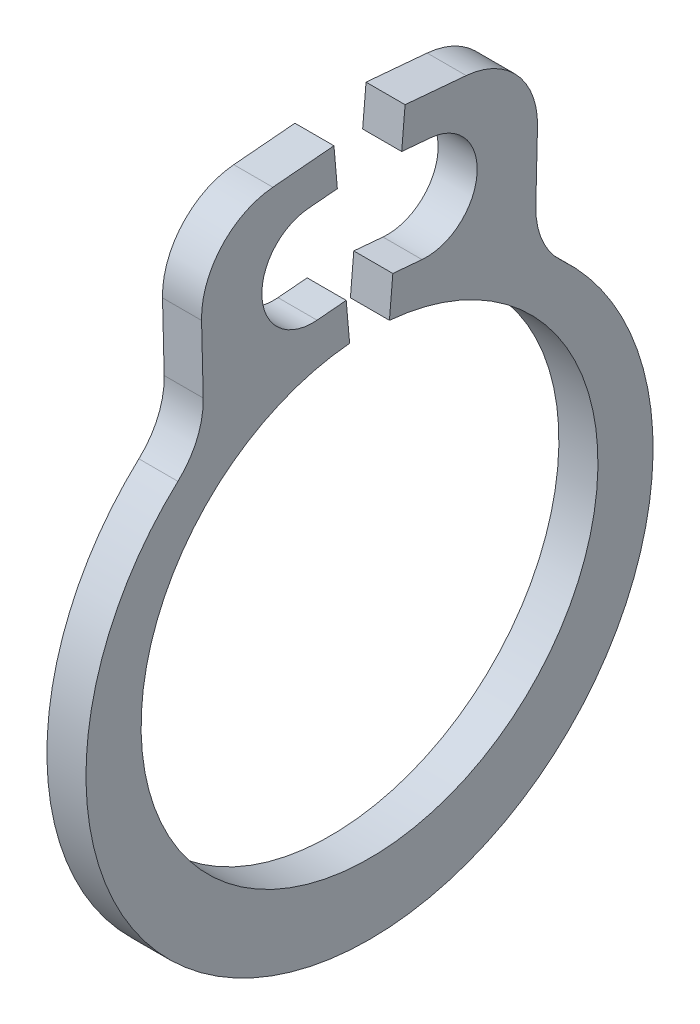
ISO-10303-21;
HEADER;
FILE_DESCRIPTION(('STEP AP214'),'2;1');
FILE_NAME('part.step','',(''),(''),'','','');
FILE_SCHEMA(('AUTOMOTIVE_DESIGN { 1 0 10303 214 1 1 1 1 }'));
ENDSEC;
DATA;
#1=APPLICATION_CONTEXT('core data for automotive mechanical design processes');
#2=APPLICATION_PROTOCOL_DEFINITION('international standard','automotive_design',2000,#1);
#3=PRODUCT_CONTEXT('',#1,'mechanical');
#4=PRODUCT('Part','Part','',(#3));
#5=PRODUCT_RELATED_PRODUCT_CATEGORY('part','',(#4));
#6=PRODUCT_DEFINITION_FORMATION('','',#4);
#7=PRODUCT_DEFINITION_CONTEXT('part definition',#1,'design');
#8=PRODUCT_DEFINITION('design','',#6,#7);
#9=PRODUCT_DEFINITION_SHAPE('','',#8);
#10=(LENGTH_UNIT() NAMED_UNIT(*) SI_UNIT(.MILLI.,.METRE.));
#11=(NAMED_UNIT(*) PLANE_ANGLE_UNIT() SI_UNIT($,.RADIAN.));
#12=(NAMED_UNIT(*) SI_UNIT($,.STERADIAN.) SOLID_ANGLE_UNIT());
#13=UNCERTAINTY_MEASURE_WITH_UNIT(LENGTH_MEASURE(1.E-05),#10,'distance_accuracy_value','');
#14=(GEOMETRIC_REPRESENTATION_CONTEXT(3) GLOBAL_UNCERTAINTY_ASSIGNED_CONTEXT((#13)) GLOBAL_UNIT_ASSIGNED_CONTEXT((#10,
#11,#12)) REPRESENTATION_CONTEXT('',''));
#15=CARTESIAN_POINT('',(0.,0.,0.));
#16=DIRECTION('',(0.,0.,1.));
#17=DIRECTION('',(1.,0.,0.));
#18=AXIS2_PLACEMENT_3D('',#15,#16,#17);
#19=CARTESIAN_POINT('',(0.126999999999933,0.,0.));
#20=DIRECTION('',(-1.,0.,0.));
#21=DIRECTION('',(0.,0.,0.999999999999998));
#22=AXIS2_PLACEMENT_3D('',#19,#20,#21);
#23=CYLINDRICAL_SURFACE('',#22,1.4859);
#24=CARTESIAN_POINT('',(-0.127000000000023,0.,0.));
#25=DIRECTION('',(-1.,0.,0.));
#26=DIRECTION('',(0.,0.,-0.999999999999998));
#27=AXIS2_PLACEMENT_3D('',#24,#25,#26);
#28=CIRCLE('',#27,1.4859);
#29=CARTESIAN_POINT('',(-0.127000000000016,1.48024570189442,-0.129504718148821));
#30=VERTEX_POINT('',#29);
#31=CARTESIAN_POINT('',(-0.127000000000044,1.48024570189445,0.12950471814871));
#32=VERTEX_POINT('',#31);
#33=EDGE_CURVE('E197',#30,#32,#28,.T.);
#34=ORIENTED_EDGE('',*,*,#33,.T.);
#35=DIRECTION('',(-1.,0.,0.));
#36=VECTOR('',#35,1.);
#37=CARTESIAN_POINT('',(0.127000000000002,1.48024570189445,0.129504718148737));
#38=LINE('',#37,#36);
#39=CARTESIAN_POINT('',(0.127000000000002,1.48024570189445,0.129504718148737));
#40=VERTEX_POINT('',#39);
#41=EDGE_CURVE('E179',#40,#32,#38,.T.);
#42=ORIENTED_EDGE('',*,*,#41,.F.);
#43=CARTESIAN_POINT('',(0.126999999999933,0.,0.));
#44=DIRECTION('',(-1.,0.,0.));
#45=DIRECTION('',(0.,0.,-0.999999999999998));
#46=AXIS2_PLACEMENT_3D('',#43,#44,#45);
#47=CIRCLE('',#46,1.4859);
#48=CARTESIAN_POINT('',(0.126999999999912,1.48024570189452,-0.129504718148765));
#49=VERTEX_POINT('',#48);
#50=EDGE_CURVE('E185',#49,#40,#47,.T.);
#51=ORIENTED_EDGE('',*,*,#50,.F.);
#52=DIRECTION('',(-1.,0.,0.));
#53=VECTOR('',#52,1.);
#54=CARTESIAN_POINT('',(0.126999999999912,1.48024570189452,-0.129504718148765));
#55=LINE('',#54,#53);
#56=EDGE_CURVE('E275',#49,#30,#55,.T.);
#57=ORIENTED_EDGE('',*,*,#56,.T.);
#58=EDGE_LOOP('',(#34,#42,#51,#57));
#59=FACE_BOUND('',#58,.T.);
#60=ADVANCED_FACE('F36',(#59),#23,.F.);
#61=CARTESIAN_POINT('',(0.126999999999995,1.73327915520979,0.151642276806613));
#62=DIRECTION('',(0.,-0.0871557427476581,0.996194698091745));
#63=DIRECTION('',(0.,-0.996194698091744,-0.0871557427476577));
#64=AXIS2_PLACEMENT_3D('',#61,#62,#63);
#65=PLANE('',#64);
#66=DIRECTION('',(0.,0.996194698091744,0.0871557427476577));
#67=VECTOR('',#66,1.);
#68=CARTESIAN_POINT('',(-0.127000000000058,1.73327915520976,0.151642276806641));
#69=LINE('',#68,#67);
#70=CARTESIAN_POINT('',(-0.127000000000058,1.73327915520976,0.151642276806641));
#71=VERTEX_POINT('',#70);
#72=EDGE_CURVE('E277',#32,#71,#69,.T.);
#73=ORIENTED_EDGE('',*,*,#72,.T.);
#74=DIRECTION('',(-1.,0.,0.));
#75=VECTOR('',#74,1.);
#76=CARTESIAN_POINT('',(0.126999999999995,1.73327915520979,0.151642276806613));
#77=LINE('',#76,#75);
#78=CARTESIAN_POINT('',(0.126999999999995,1.73327915520979,0.151642276806613));
#79=VERTEX_POINT('',#78);
#80=EDGE_CURVE('E182',#79,#71,#77,.T.);
#81=ORIENTED_EDGE('',*,*,#80,.F.);
#82=DIRECTION('',(0.,0.996194698091744,0.0871557427476577));
#83=VECTOR('',#82,1.);
#84=CARTESIAN_POINT('',(0.126999999999995,1.73327915520979,0.151642276806613));
#85=LINE('',#84,#83);
#86=EDGE_CURVE('E175',#40,#79,#85,.T.);
#87=ORIENTED_EDGE('',*,*,#86,.F.);
#88=ORIENTED_EDGE('',*,*,#41,.T.);
#89=EDGE_LOOP('',(#73,#81,#87,#88));
#90=FACE_BOUND('',#89,.T.);
#91=ADVANCED_FACE('F177',(#90),#65,.F.);
#92=CARTESIAN_POINT('',(0.126999999999995,1.73327915520979,0.151642276806613));
#93=DIRECTION('',(0.,-0.996194698091743,-0.0871557427476583));
#94=DIRECTION('',(0.,0.087155742747658,-0.996194698091743));
#95=AXIS2_PLACEMENT_3D('',#92,#93,#94);
#96=PLANE('',#95);
#97=DIRECTION('',(0.,-0.087155742747658,0.996194698091743));
#98=VECTOR('',#97,1.);
#99=CARTESIAN_POINT('',(-0.127000000000058,1.73327915520976,0.151642276806641));
#100=LINE('',#99,#98);
#101=CARTESIAN_POINT('',(-0.126999999999995,1.71667598621633,0.341417366793106));
#102=VERTEX_POINT('',#101);
#103=EDGE_CURVE('E279',#71,#102,#100,.T.);
#104=ORIENTED_EDGE('',*,*,#103,.T.);
#105=DIRECTION('',(-1.,0.,0.));
#106=VECTOR('',#105,1.);
#107=CARTESIAN_POINT('',(0.126999999999988,1.71667598621627,0.341417366793106));
#108=LINE('',#107,#106);
#109=CARTESIAN_POINT('',(0.126999999999988,1.71667598621627,0.341417366793106));
#110=VERTEX_POINT('',#109);
#111=EDGE_CURVE('E202',#110,#102,#108,.T.);
#112=ORIENTED_EDGE('',*,*,#111,.F.);
#113=DIRECTION('',(0.,-0.087155742747658,0.996194698091743));
#114=VECTOR('',#113,1.);
#115=CARTESIAN_POINT('',(0.126999999999995,1.73327915520979,0.151642276806613));
#116=LINE('',#115,#114);
#117=EDGE_CURVE('E184',#79,#110,#116,.T.);
#118=ORIENTED_EDGE('',*,*,#117,.F.);
#119=ORIENTED_EDGE('',*,*,#80,.T.);
#120=EDGE_LOOP('',(#104,#112,#118,#119));
#121=FACE_BOUND('',#120,.T.);
#122=ADVANCED_FACE('F381',(#121),#96,.F.);
#123=CARTESIAN_POINT('',(0.126999999999919,2.04561947552623,0.3701961930484));
#124=DIRECTION('',(-1.,0.,0.));
#125=DIRECTION('',(0.,0.,0.999999999999998));
#126=AXIS2_PLACEMENT_3D('',#123,#124,#125);
#127=CYLINDRICAL_SURFACE('',#126,0.3302);
#128=CARTESIAN_POINT('',(-0.127000000000072,2.04561947552622,0.370196193048386));
#129=DIRECTION('',(-1.,0.,0.));
#130=DIRECTION('',(0.,0.,0.999999999999998));
#131=AXIS2_PLACEMENT_3D('',#128,#129,#130);
#132=CIRCLE('',#131,0.3302);
#133=CARTESIAN_POINT('',(-0.127000000000051,2.37456296483611,0.398975019303652));
#134=VERTEX_POINT('',#133);
#135=EDGE_CURVE('E281',#102,#134,#132,.T.);
#136=ORIENTED_EDGE('',*,*,#135,.T.);
#137=DIRECTION('',(-1.,0.,0.));
#138=VECTOR('',#137,1.);
#139=CARTESIAN_POINT('',(0.126999999999988,2.37456296483612,0.398975019303666));
#140=LINE('',#139,#138);
#141=CARTESIAN_POINT('',(0.126999999999988,2.37456296483612,0.398975019303666));
#142=VERTEX_POINT('',#141);
#143=EDGE_CURVE('E325',#142,#134,#140,.T.);
#144=ORIENTED_EDGE('',*,*,#143,.F.);
#145=CARTESIAN_POINT('',(0.126999999999919,2.04561947552623,0.3701961930484));
#146=DIRECTION('',(-1.,0.,0.));
#147=DIRECTION('',(0.,0.,0.999999999999998));
#148=AXIS2_PLACEMENT_3D('',#145,#146,#147);
#149=CIRCLE('',#148,0.3302);
#150=EDGE_CURVE('E334',#110,#142,#149,.T.);
#151=ORIENTED_EDGE('',*,*,#150,.F.);
#152=ORIENTED_EDGE('',*,*,#111,.T.);
#153=EDGE_LOOP('',(#136,#144,#151,#152));
#154=FACE_BOUND('',#153,.T.);
#155=ADVANCED_FACE('F332',(#154),#127,.F.);
#156=CARTESIAN_POINT('',(0.126999999999995,2.39116613382955,0.209199929317172));
#157=DIRECTION('',(0.,0.996194698091743,0.0871557427476583));
#158=DIRECTION('',(0.,-0.087155742747658,0.996194698091743));
#159=AXIS2_PLACEMENT_3D('',#156,#157,#158);
#160=PLANE('',#159);
#161=DIRECTION('',(0.,0.087155742747658,-0.996194698091743));
#162=VECTOR('',#161,1.);
#163=CARTESIAN_POINT('',(-0.12700000000003,2.39116613382961,0.209199929317172));
#164=LINE('',#163,#162);
#165=CARTESIAN_POINT('',(-0.12700000000003,2.39116613382961,0.209199929317172));
#166=VERTEX_POINT('',#165);
#167=EDGE_CURVE('E283',#134,#166,#164,.T.);
#168=ORIENTED_EDGE('',*,*,#167,.T.);
#169=DIRECTION('',(-1.,0.,0.));
#170=VECTOR('',#169,1.);
#171=CARTESIAN_POINT('',(0.126999999999995,2.39116613382955,0.209199929317172));
#172=LINE('',#171,#170);
#173=CARTESIAN_POINT('',(0.126999999999995,2.39116613382955,0.209199929317172));
#174=VERTEX_POINT('',#173);
#175=EDGE_CURVE('E322',#174,#166,#172,.T.);
#176=ORIENTED_EDGE('',*,*,#175,.F.);
#177=DIRECTION('',(0.,0.087155742747658,-0.996194698091743));
#178=VECTOR('',#177,1.);
#179=CARTESIAN_POINT('',(0.126999999999995,2.39116613382955,0.209199929317172));
#180=LINE('',#179,#178);
#181=EDGE_CURVE('E350',#142,#174,#180,.T.);
#182=ORIENTED_EDGE('',*,*,#181,.F.);
#183=ORIENTED_EDGE('',*,*,#143,.T.);
#184=EDGE_LOOP('',(#168,#176,#182,#183));
#185=FACE_BOUND('',#184,.T.);
#186=ADVANCED_FACE('F342',(#185),#160,.F.);
#187=CARTESIAN_POINT('',(0.126999999999995,2.39116613382955,0.209199929317172));
#188=DIRECTION('',(0.,-0.0871557427476581,0.996194698091745));
#189=DIRECTION('',(0.,-0.996194698091744,-0.0871557427476577));
#190=AXIS2_PLACEMENT_3D('',#187,#188,#189);
#191=PLANE('',#190);
#192=DIRECTION('',(0.,0.996194698091744,0.0871557427476577));
#193=VECTOR('',#192,1.);
#194=CARTESIAN_POINT('',(-0.12700000000003,2.39116613382961,0.209199929317172));
#195=LINE('',#194,#193);
#196=CARTESIAN_POINT('',(-0.127000000000016,2.64419958714485,0.231337487975047));
#197=VERTEX_POINT('',#196);
#198=EDGE_CURVE('E285',#166,#197,#195,.T.);
#199=ORIENTED_EDGE('',*,*,#198,.T.);
#200=DIRECTION('',(-1.,0.,0.));
#201=VECTOR('',#200,1.);
#202=CARTESIAN_POINT('',(0.12699999999994,2.64419958714488,0.231337487975089));
#203=LINE('',#202,#201);
#204=CARTESIAN_POINT('',(0.12699999999994,2.64419958714488,0.231337487975089));
#205=VERTEX_POINT('',#204);
#206=EDGE_CURVE('E319',#205,#197,#203,.T.);
#207=ORIENTED_EDGE('',*,*,#206,.F.);
#208=DIRECTION('',(0.,0.996194698091744,0.0871557427476577));
#209=VECTOR('',#208,1.);
#210=CARTESIAN_POINT('',(0.126999999999995,2.39116613382955,0.209199929317172));
#211=LINE('',#210,#209);
#212=EDGE_CURVE('E348',#174,#205,#211,.T.);
#213=ORIENTED_EDGE('',*,*,#212,.F.);
#214=ORIENTED_EDGE('',*,*,#175,.T.);
#215=EDGE_LOOP('',(#199,#207,#213,#214));
#216=FACE_BOUND('',#215,.T.);
#217=ADVANCED_FACE('F346',(#216),#191,.F.);
#218=CARTESIAN_POINT('',(0.12699999999994,2.64419958714488,0.231337487975089));
#219=DIRECTION('',(0.,-0.996194698091744,-0.087155742747658));
#220=DIRECTION('',(0.,0.0871557427476574,-0.996194698091742));
#221=AXIS2_PLACEMENT_3D('',#218,#219,#220);
#222=PLANE('',#221);
#223=DIRECTION('',(0.,-0.0871557427476574,0.996194698091742));
#224=VECTOR('',#223,1.);
#225=CARTESIAN_POINT('',(-0.127000000000016,2.64419958714485,0.231337487975047));
#226=LINE('',#225,#224);
#227=CARTESIAN_POINT('',(-0.127000000000078,2.60940783718214,0.629009009753448));
#228=VERTEX_POINT('',#227);
#229=EDGE_CURVE('E287',#197,#228,#226,.T.);
#230=ORIENTED_EDGE('',*,*,#229,.T.);
#231=DIRECTION('',(-1.,0.,0.));
#232=VECTOR('',#231,1.);
#233=CARTESIAN_POINT('',(0.126999999999926,2.60940783718214,0.629009009753448));
#234=LINE('',#233,#232);
#235=CARTESIAN_POINT('',(0.126999999999926,2.60940783718214,0.629009009753448));
#236=VERTEX_POINT('',#235);
#237=EDGE_CURVE('E59',#228,#236,#234,.F.);
#238=ORIENTED_EDGE('',*,*,#237,.T.);
#239=DIRECTION('',(0.,-0.0871557427476574,0.996194698091742));
#240=VECTOR('',#239,1.);
#241=CARTESIAN_POINT('',(0.12699999999994,2.64419958714488,0.231337487975089));
#242=LINE('',#241,#240);
#243=EDGE_CURVE('E349',#205,#236,#242,.T.);
#244=ORIENTED_EDGE('',*,*,#243,.F.);
#245=ORIENTED_EDGE('',*,*,#206,.T.);
#246=EDGE_LOOP('',(#230,#238,#244,#245));
#247=FACE_BOUND('',#246,.T.);
#248=ADVANCED_FACE('F367',(#247),#222,.F.);
#249=CARTESIAN_POINT('',(0.127000000000002,2.56782500977515,1.10430290191291));
#250=DIRECTION('',(0.,0.0245695473898542,-0.999698123105698));
#251=DIRECTION('',(0.,0.999698123105698,0.0245695473898548));
#252=AXIS2_PLACEMENT_3D('',#249,#250,#251);
#253=PLANE('',#252);
#254=DIRECTION('',(0.,-0.999698123105698,-0.0245695473898548));
#255=VECTOR('',#254,1.);
#256=CARTESIAN_POINT('',(-0.127000000000085,2.5678250097751,1.10430290191291));
#257=LINE('',#256,#255);
#258=CARTESIAN_POINT('',(-0.127000000000113,2.09085960047749,1.0925805389753));
#259=VERTEX_POINT('',#258);
#260=CARTESIAN_POINT('',(-0.127000000000023,1.64807694077318,1.08169828433304));
#261=VERTEX_POINT('',#260);
#262=EDGE_CURVE('E249',#259,#261,#257,.T.);
#263=ORIENTED_EDGE('',*,*,#262,.T.);
#264=DIRECTION('',(1.,0.,0.));
#265=VECTOR('',#264,1.);
#266=CARTESIAN_POINT('',(0.127000000000016,1.64807694077312,1.08169828433306));
#267=LINE('',#266,#265);
#268=CARTESIAN_POINT('',(0.127000000000016,1.64807694077312,1.08169828433306));
#269=VERTEX_POINT('',#268);
#270=EDGE_CURVE('E211',#261,#269,#267,.T.);
#271=ORIENTED_EDGE('',*,*,#270,.T.);
#272=DIRECTION('',(0.,-0.999698123105698,-0.0245695473898548));
#273=VECTOR('',#272,1.);
#274=CARTESIAN_POINT('',(0.127000000000002,2.56782500977515,1.10430290191291));
#275=LINE('',#274,#273);
#276=CARTESIAN_POINT('',(0.126999999999981,2.09085960047748,1.0925805389753));
#277=VERTEX_POINT('',#276);
#278=EDGE_CURVE('E263',#277,#269,#275,.T.);
#279=ORIENTED_EDGE('',*,*,#278,.F.);
#280=DIRECTION('',(-1.,0.,0.));
#281=VECTOR('',#280,1.);
#282=CARTESIAN_POINT('',(0.126999999999981,2.09085960047748,1.0925805389753));
#283=LINE('',#282,#281);
#284=EDGE_CURVE('E208',#277,#259,#283,.T.);
#285=ORIENTED_EDGE('',*,*,#284,.T.);
#286=EDGE_LOOP('',(#263,#271,#279,#285));
#287=FACE_BOUND('',#286,.T.);
#288=ADVANCED_FACE('F364',(#287),#253,.F.);
#289=CARTESIAN_POINT('',(0.126999999999981,-0.0986206458458948,0.));
#290=DIRECTION('',(-1.,0.,0.));
#291=DIRECTION('',(0.,0.,0.999999999999998));
#292=AXIS2_PLACEMENT_3D('',#289,#290,#291);
#293=CYLINDRICAL_SURFACE('',#292,1.8444793541542);
#294=CARTESIAN_POINT('',(0.126999999999981,-0.0986206458458948,0.));
#295=DIRECTION('',(1.,0.,0.));
#296=DIRECTION('',(0.,0.,-0.999999999999998));
#297=AXIS2_PLACEMENT_3D('',#294,#295,#296);
#298=CIRCLE('',#297,1.8444793541542);
#299=CARTESIAN_POINT('',(0.127000000000009,1.26110481792371,1.24629480905505));
#300=VERTEX_POINT('',#299);
#301=CARTESIAN_POINT('',(0.127000000000044,1.26110481792381,-1.24629480905508));
#302=VERTEX_POINT('',#301);
#303=EDGE_CURVE('E255',#300,#302,#298,.T.);
#304=ORIENTED_EDGE('',*,*,#303,.F.);
#305=DIRECTION('',(-1.,0.,0.));
#306=VECTOR('',#305,1.);
#307=CARTESIAN_POINT('',(0.127000000000009,1.26110481792371,1.24629480905505));
#308=LINE('',#307,#306);
#309=CARTESIAN_POINT('',(-0.127000000000016,1.26110481792371,1.24629480905504));
#310=VERTEX_POINT('',#309);
#311=EDGE_CURVE('E200',#300,#310,#308,.T.);
#312=ORIENTED_EDGE('',*,*,#311,.T.);
#313=CARTESIAN_POINT('',(-0.126999999999988,-0.0986206458458462,0.));
#314=DIRECTION('',(1.,0.,0.));
#315=DIRECTION('',(0.,0.,-0.999999999999998));
#316=AXIS2_PLACEMENT_3D('',#313,#314,#315);
#317=CIRCLE('',#316,1.8444793541542);
#318=CARTESIAN_POINT('',(-0.127000000000037,1.26110481792376,-1.2462948090551));
#319=VERTEX_POINT('',#318);
#320=EDGE_CURVE('E238',#310,#319,#317,.T.);
#321=ORIENTED_EDGE('',*,*,#320,.T.);
#322=DIRECTION('',(-1.,0.,0.));
#323=VECTOR('',#322,1.);
#324=CARTESIAN_POINT('',(0.127000000000044,1.26110481792381,-1.24629480905508));
#325=LINE('',#324,#323);
#326=EDGE_CURVE('E198',#319,#302,#325,.F.);
#327=ORIENTED_EDGE('',*,*,#326,.T.);
#328=EDGE_LOOP('',(#304,#312,#321,#327));
#329=FACE_BOUND('',#328,.T.);
#330=ADVANCED_FACE('F246',(#329),#293,.T.);
#331=CARTESIAN_POINT('',(0.126999999999926,2.5678250097751,-1.10430290191293));
#332=DIRECTION('',(0.,0.024569547389855,0.999698123105697));
#333=DIRECTION('',(0.,-0.999698123105698,0.024569547389856));
#334=AXIS2_PLACEMENT_3D('',#331,#332,#333);
#335=PLANE('',#334);
#336=DIRECTION('',(0.,0.999698123105698,-0.0245695473898551));
#337=VECTOR('',#336,1.);
#338=CARTESIAN_POINT('',(0.126999999999926,2.5678250097751,-1.10430290191293));
#339=LINE('',#338,#337);
#340=CARTESIAN_POINT('',(0.127000000000009,1.64807694077313,-1.0816982843331));
#341=VERTEX_POINT('',#340);
#342=CARTESIAN_POINT('',(0.126999999999967,2.09085960047755,-1.09258053897532));
#343=VERTEX_POINT('',#342);
#344=EDGE_CURVE('E254',#341,#343,#339,.T.);
#345=ORIENTED_EDGE('',*,*,#344,.F.);
#346=DIRECTION('',(1.,0.,0.));
#347=VECTOR('',#346,1.);
#348=CARTESIAN_POINT('',(-0.12700000000003,1.6480769407731,-1.08169828433308));
#349=LINE('',#348,#347);
#350=CARTESIAN_POINT('',(-0.12700000000003,1.6480769407731,-1.08169828433308));
#351=VERTEX_POINT('',#350);
#352=EDGE_CURVE('E215',#341,#351,#349,.F.);
#353=ORIENTED_EDGE('',*,*,#352,.T.);
#354=DIRECTION('',(0.,0.999698123105698,-0.0245695473898551));
#355=VECTOR('',#354,1.);
#356=CARTESIAN_POINT('',(-0.127000000000016,2.56782500977509,-1.10430290191291));
#357=LINE('',#356,#355);
#358=CARTESIAN_POINT('',(-0.127000000000113,2.09085960047749,-1.09258053897535));
#359=VERTEX_POINT('',#358);
#360=EDGE_CURVE('E240',#351,#359,#357,.T.);
#361=ORIENTED_EDGE('',*,*,#360,.T.);
#362=DIRECTION('',(-1.,0.,0.));
#363=VECTOR('',#362,1.);
#364=CARTESIAN_POINT('',(0.126999999999967,2.09085960047755,-1.09258053897532));
#365=LINE('',#364,#363);
#366=EDGE_CURVE('E213',#359,#343,#365,.F.);
#367=ORIENTED_EDGE('',*,*,#366,.T.);
#368=EDGE_LOOP('',(#345,#353,#361,#367));
#369=FACE_BOUND('',#368,.T.);
#370=ADVANCED_FACE('F257',(#369),#335,.F.);
#371=CARTESIAN_POINT('',(0.126999999999926,2.64419958714486,-0.231337487975103));
#372=DIRECTION('',(0.,-0.996194698091744,0.0871557427476594));
#373=DIRECTION('',(0.,-0.0871557427476596,-0.996194698091743));
#374=AXIS2_PLACEMENT_3D('',#371,#372,#373);
#375=PLANE('',#374);
#376=DIRECTION('',(0.,0.0871557427476596,0.996194698091743));
#377=VECTOR('',#376,1.);
#378=CARTESIAN_POINT('',(0.126999999999926,2.64419958714486,-0.231337487975103));
#379=LINE('',#378,#377);
#380=CARTESIAN_POINT('',(0.126999999999933,2.60940783718215,-0.629009009753476));
#381=VERTEX_POINT('',#380);
#382=CARTESIAN_POINT('',(0.126999999999926,2.64419958714486,-0.231337487975103));
#383=VERTEX_POINT('',#382);
#384=EDGE_CURVE('E259',#381,#383,#379,.T.);
#385=ORIENTED_EDGE('',*,*,#384,.F.);
#386=DIRECTION('',(-1.,0.,0.));
#387=VECTOR('',#386,1.);
#388=CARTESIAN_POINT('',(0.126999999999933,2.60940783718215,-0.629009009753476));
#389=LINE('',#388,#387);
#390=CARTESIAN_POINT('',(-0.127000000000078,2.60940783718214,-0.629009009753476));
#391=VERTEX_POINT('',#390);
#392=EDGE_CURVE('E226',#381,#391,#389,.T.);
#393=ORIENTED_EDGE('',*,*,#392,.T.);
#394=DIRECTION('',(0.,0.0871557427476596,0.996194698091743));
#395=VECTOR('',#394,1.);
#396=CARTESIAN_POINT('',(-0.127000000000058,2.6441995871449,-0.231337487975158));
#397=LINE('',#396,#395);
#398=CARTESIAN_POINT('',(-0.127000000000058,2.6441995871449,-0.231337487975158));
#399=VERTEX_POINT('',#398);
#400=EDGE_CURVE('E292',#391,#399,#397,.T.);
#401=ORIENTED_EDGE('',*,*,#400,.T.);
#402=DIRECTION('',(-1.,0.,0.));
#403=VECTOR('',#402,1.);
#404=CARTESIAN_POINT('',(0.126999999999926,2.64419958714486,-0.231337487975103));
#405=LINE('',#404,#403);
#406=EDGE_CURVE('E316',#383,#399,#405,.T.);
#407=ORIENTED_EDGE('',*,*,#406,.F.);
#408=EDGE_LOOP('',(#385,#393,#401,#407));
#409=FACE_BOUND('',#408,.T.);
#410=ADVANCED_FACE('F398',(#409),#375,.F.);
#411=CARTESIAN_POINT('',(0.126999999999988,2.39116613382956,-0.2091999293172));
#412=DIRECTION('',(0.,-0.0871557427476585,-0.996194698091744));
#413=DIRECTION('',(0.,0.996194698091744,-0.0871557427476591));
#414=AXIS2_PLACEMENT_3D('',#411,#412,#413);
#415=PLANE('',#414);
#416=DIRECTION('',(0.,-0.996194698091744,0.0871557427476591));
#417=VECTOR('',#416,1.);
#418=CARTESIAN_POINT('',(-0.12700000000003,2.39116613382957,-0.209199929317228));
#419=LINE('',#418,#417);
#420=CARTESIAN_POINT('',(-0.12700000000003,2.39116613382957,-0.209199929317228));
#421=VERTEX_POINT('',#420);
#422=EDGE_CURVE('E294',#399,#421,#419,.T.);
#423=ORIENTED_EDGE('',*,*,#422,.T.);
#424=DIRECTION('',(-1.,0.,0.));
#425=VECTOR('',#424,1.);
#426=CARTESIAN_POINT('',(0.126999999999988,2.39116613382956,-0.2091999293172));
#427=LINE('',#426,#425);
#428=CARTESIAN_POINT('',(0.126999999999988,2.39116613382956,-0.2091999293172));
#429=VERTEX_POINT('',#428);
#430=EDGE_CURVE('E313',#429,#421,#427,.T.);
#431=ORIENTED_EDGE('',*,*,#430,.F.);
#432=DIRECTION('',(0.,-0.996194698091744,0.0871557427476591));
#433=VECTOR('',#432,1.);
#434=CARTESIAN_POINT('',(0.126999999999988,2.39116613382956,-0.2091999293172));
#435=LINE('',#434,#433);
#436=EDGE_CURVE('E261',#383,#429,#435,.T.);
#437=ORIENTED_EDGE('',*,*,#436,.F.);
#438=ORIENTED_EDGE('',*,*,#406,.T.);
#439=EDGE_LOOP('',(#423,#431,#437,#438));
#440=FACE_BOUND('',#439,.T.);
#441=ADVANCED_FACE('F405',(#440),#415,.F.);
#442=CARTESIAN_POINT('',(0.126999999999988,2.39116613382956,-0.2091999293172));
#443=DIRECTION('',(0.,0.996194698091744,-0.0871557427476596));
#444=DIRECTION('',(0.,0.0871557427476597,0.996194698091743));
#445=AXIS2_PLACEMENT_3D('',#442,#443,#444);
#446=PLANE('',#445);
#447=DIRECTION('',(0.,-0.0871557427476597,-0.996194698091743));
#448=VECTOR('',#447,1.);
#449=CARTESIAN_POINT('',(-0.12700000000003,2.39116613382957,-0.209199929317228));
#450=LINE('',#449,#448);
#451=CARTESIAN_POINT('',(-0.127000000000072,2.37456296483618,-0.398975019303721));
#452=VERTEX_POINT('',#451);
#453=EDGE_CURVE('E296',#421,#452,#450,.T.);
#454=ORIENTED_EDGE('',*,*,#453,.T.);
#455=DIRECTION('',(-1.,0.,0.));
#456=VECTOR('',#455,1.);
#457=CARTESIAN_POINT('',(0.12699999999996,2.37456296483609,-0.398975019303721));
#458=LINE('',#457,#456);
#459=CARTESIAN_POINT('',(0.12699999999996,2.37456296483609,-0.398975019303721));
#460=VERTEX_POINT('',#459);
#461=EDGE_CURVE('E310',#460,#452,#458,.T.);
#462=ORIENTED_EDGE('',*,*,#461,.F.);
#463=DIRECTION('',(0.,-0.0871557427476597,-0.996194698091743));
#464=VECTOR('',#463,1.);
#465=CARTESIAN_POINT('',(0.126999999999988,2.39116613382956,-0.2091999293172));
#466=LINE('',#465,#464);
#467=EDGE_CURVE('E268',#429,#460,#466,.T.);
#468=ORIENTED_EDGE('',*,*,#467,.F.);
#469=ORIENTED_EDGE('',*,*,#430,.T.);
#470=EDGE_LOOP('',(#454,#462,#468,#469));
#471=FACE_BOUND('',#470,.T.);
#472=ADVANCED_FACE('F409',(#471),#446,.F.);
#473=CARTESIAN_POINT('',(0.126999999999974,2.0456194755262,-0.370196193048442));
#474=DIRECTION('',(-1.,0.,0.));
#475=DIRECTION('',(0.,0.,0.999999999999998));
#476=AXIS2_PLACEMENT_3D('',#473,#474,#475);
#477=CYLINDRICAL_SURFACE('',#476,0.3302);
#478=CARTESIAN_POINT('',(-0.127000000000037,2.04561947552629,-0.370196193048455));
#479=DIRECTION('',(-1.,0.,0.));
#480=DIRECTION('',(0.,0.,-0.999999999999998));
#481=AXIS2_PLACEMENT_3D('',#478,#479,#480);
#482=CIRCLE('',#481,0.3302);
#483=CARTESIAN_POINT('',(-0.12700000000003,1.71667598621639,-0.34141736679319));
#484=VERTEX_POINT('',#483);
#485=EDGE_CURVE('E298',#452,#484,#482,.T.);
#486=ORIENTED_EDGE('',*,*,#485,.T.);
#487=DIRECTION('',(-1.,0.,0.));
#488=VECTOR('',#487,1.);
#489=CARTESIAN_POINT('',(0.126999999999863,1.71667598621633,-0.341417366793162));
#490=LINE('',#489,#488);
#491=CARTESIAN_POINT('',(0.126999999999863,1.71667598621633,-0.341417366793162));
#492=VERTEX_POINT('',#491);
#493=EDGE_CURVE('E307',#492,#484,#490,.T.);
#494=ORIENTED_EDGE('',*,*,#493,.F.);
#495=CARTESIAN_POINT('',(0.126999999999974,2.0456194755262,-0.370196193048442));
#496=DIRECTION('',(-1.,0.,0.));
#497=DIRECTION('',(0.,0.,-0.999999999999998));
#498=AXIS2_PLACEMENT_3D('',#495,#496,#497);
#499=CIRCLE('',#498,0.3302);
#500=EDGE_CURVE('E270',#460,#492,#499,.T.);
#501=ORIENTED_EDGE('',*,*,#500,.F.);
#502=ORIENTED_EDGE('',*,*,#461,.T.);
#503=EDGE_LOOP('',(#486,#494,#501,#502));
#504=FACE_BOUND('',#503,.T.);
#505=ADVANCED_FACE('F416',(#504),#477,.F.);
#506=CARTESIAN_POINT('',(0.126999999999981,1.73327915520978,-0.151642276806668));
#507=DIRECTION('',(0.,-0.996194698091744,0.0871557427476596));
#508=DIRECTION('',(0.,-0.0871557427476597,-0.996194698091743));
#509=AXIS2_PLACEMENT_3D('',#506,#507,#508);
#510=PLANE('',#509);
#511=DIRECTION('',(0.,0.0871557427476597,0.996194698091743));
#512=VECTOR('',#511,1.);
#513=CARTESIAN_POINT('',(-0.127000000000016,1.73327915520974,-0.151642276806668));
#514=LINE('',#513,#512);
#515=CARTESIAN_POINT('',(-0.127000000000016,1.73327915520974,-0.151642276806668));
#516=VERTEX_POINT('',#515);
#517=EDGE_CURVE('E300',#484,#516,#514,.T.);
#518=ORIENTED_EDGE('',*,*,#517,.T.);
#519=DIRECTION('',(-1.,0.,0.));
#520=VECTOR('',#519,1.);
#521=CARTESIAN_POINT('',(0.126999999999981,1.73327915520978,-0.151642276806668));
#522=LINE('',#521,#520);
#523=CARTESIAN_POINT('',(0.126999999999981,1.73327915520978,-0.151642276806668));
#524=VERTEX_POINT('',#523);
#525=EDGE_CURVE('E304',#524,#516,#522,.T.);
#526=ORIENTED_EDGE('',*,*,#525,.F.);
#527=DIRECTION('',(0.,0.0871557427476597,0.996194698091743));
#528=VECTOR('',#527,1.);
#529=CARTESIAN_POINT('',(0.126999999999981,1.73327915520978,-0.151642276806668));
#530=LINE('',#529,#528);
#531=EDGE_CURVE('E272',#492,#524,#530,.T.);
#532=ORIENTED_EDGE('',*,*,#531,.F.);
#533=ORIENTED_EDGE('',*,*,#493,.T.);
#534=EDGE_LOOP('',(#518,#526,#532,#533));
#535=FACE_BOUND('',#534,.T.);
#536=ADVANCED_FACE('F419',(#535),#510,.F.);
#537=CARTESIAN_POINT('',(0.126999999999981,1.73327915520978,-0.151642276806668));
#538=DIRECTION('',(0.,-0.0871557427476585,-0.996194698091744));
#539=DIRECTION('',(0.,0.996194698091744,-0.0871557427476591));
#540=AXIS2_PLACEMENT_3D('',#537,#538,#539);
#541=PLANE('',#540);
#542=DIRECTION('',(0.,-0.996194698091744,0.0871557427476591));
#543=VECTOR('',#542,1.);
#544=CARTESIAN_POINT('',(-0.127000000000016,1.73327915520974,-0.151642276806668));
#545=LINE('',#544,#543);
#546=EDGE_CURVE('E194',#516,#30,#545,.T.);
#547=ORIENTED_EDGE('',*,*,#546,.T.);
#548=ORIENTED_EDGE('',*,*,#56,.F.);
#549=DIRECTION('',(0.,-0.996194698091744,0.0871557427476591));
#550=VECTOR('',#549,1.);
#551=CARTESIAN_POINT('',(0.126999999999981,1.73327915520978,-0.151642276806668));
#552=LINE('',#551,#550);
#553=EDGE_CURVE('E190',#524,#49,#552,.T.);
#554=ORIENTED_EDGE('',*,*,#553,.F.);
#555=ORIENTED_EDGE('',*,*,#525,.T.);
#556=EDGE_LOOP('',(#547,#548,#554,#555));
#557=FACE_BOUND('',#556,.T.);
#558=ADVANCED_FACE('F422',(#557),#541,.F.);
#559=CARTESIAN_POINT('',(0.126999999999933,0.,0.));
#560=DIRECTION('',(1.,0.,0.));
#561=DIRECTION('',(0.,0.,-0.999999999999998));
#562=AXIS2_PLACEMENT_3D('',#559,#560,#561);
#563=PLANE('',#562);
#564=ORIENTED_EDGE('',*,*,#243,.T.);
#565=CARTESIAN_POINT('',(0.126999999999947,2.10334093055157,0.5847338924376));
#566=DIRECTION('',(1.,0.,0.));
#567=DIRECTION('',(0.,0.,-0.999999999999998));
#568=AXIS2_PLACEMENT_3D('',#565,#566,#567);
#569=CIRCLE('',#568,0.508);
#570=EDGE_CURVE('E224',#236,#277,#569,.T.);
#571=ORIENTED_EDGE('',*,*,#570,.T.);
#572=ORIENTED_EDGE('',*,*,#278,.T.);
#573=CARTESIAN_POINT('',(0.126999999999877,1.63559561069908,1.58954493087077));
#574=DIRECTION('',(1.,0.,0.));
#575=DIRECTION('',(0.,0.,-0.999999999999998));
#576=AXIS2_PLACEMENT_3D('',#573,#574,#575);
#577=CIRCLE('',#576,0.508);
#578=EDGE_CURVE('E231',#269,#300,#577,.F.);
#579=ORIENTED_EDGE('',*,*,#578,.T.);
#580=ORIENTED_EDGE('',*,*,#303,.T.);
#581=CARTESIAN_POINT('',(0.126999999999954,1.63559561069909,-1.58954493087077));
#582=DIRECTION('',(1.,0.,0.));
#583=DIRECTION('',(0.,0.,-0.999999999999998));
#584=AXIS2_PLACEMENT_3D('',#581,#582,#583);
#585=CIRCLE('',#584,0.508);
#586=EDGE_CURVE('E11',#302,#341,#585,.F.);
#587=ORIENTED_EDGE('',*,*,#586,.T.);
#588=ORIENTED_EDGE('',*,*,#344,.T.);
#589=CARTESIAN_POINT('',(0.12699999999996,2.10334093055153,-0.584733892437628));
#590=DIRECTION('',(1.,0.,0.));
#591=DIRECTION('',(0.,0.,-0.999999999999998));
#592=AXIS2_PLACEMENT_3D('',#589,#590,#591);
#593=CIRCLE('',#592,0.508);
#594=EDGE_CURVE('E51',#343,#381,#593,.T.);
#595=ORIENTED_EDGE('',*,*,#594,.T.);
#596=ORIENTED_EDGE('',*,*,#384,.T.);
#597=ORIENTED_EDGE('',*,*,#436,.T.);
#598=ORIENTED_EDGE('',*,*,#467,.T.);
#599=ORIENTED_EDGE('',*,*,#500,.T.);
#600=ORIENTED_EDGE('',*,*,#531,.T.);
#601=ORIENTED_EDGE('',*,*,#553,.T.);
#602=ORIENTED_EDGE('',*,*,#50,.T.);
#603=ORIENTED_EDGE('',*,*,#86,.T.);
#604=ORIENTED_EDGE('',*,*,#117,.T.);
#605=ORIENTED_EDGE('',*,*,#150,.T.);
#606=ORIENTED_EDGE('',*,*,#181,.T.);
#607=ORIENTED_EDGE('',*,*,#212,.T.);
#608=EDGE_LOOP('',(#564,#571,#572,#579,#580,#587,#588,#595,#596,#597,#598,#599,#600,#601,#602,
#603,#604,#605,#606,#607));
#609=FACE_BOUND('',#608,.T.);
#610=ADVANCED_FACE('F188',(#609),#563,.T.);
#611=CARTESIAN_POINT('',(-0.127000000000023,0.,0.));
#612=DIRECTION('',(1.,0.,0.));
#613=DIRECTION('',(0.,0.,-0.999999999999998));
#614=AXIS2_PLACEMENT_3D('',#611,#612,#613);
#615=PLANE('',#614);
#616=ORIENTED_EDGE('',*,*,#262,.F.);
#617=CARTESIAN_POINT('',(-0.126999999999988,2.10334093055153,0.5847338924376));
#618=DIRECTION('',(1.,0.,0.));
#619=DIRECTION('',(0.,0.,-0.999999999999998));
#620=AXIS2_PLACEMENT_3D('',#617,#618,#619);
#621=CIRCLE('',#620,0.508);
#622=EDGE_CURVE('E220',#259,#228,#621,.F.);
#623=ORIENTED_EDGE('',*,*,#622,.T.);
#624=ORIENTED_EDGE('',*,*,#229,.F.);
#625=ORIENTED_EDGE('',*,*,#198,.F.);
#626=ORIENTED_EDGE('',*,*,#167,.F.);
#627=ORIENTED_EDGE('',*,*,#135,.F.);
#628=ORIENTED_EDGE('',*,*,#103,.F.);
#629=ORIENTED_EDGE('',*,*,#72,.F.);
#630=ORIENTED_EDGE('',*,*,#33,.F.);
#631=ORIENTED_EDGE('',*,*,#546,.F.);
#632=ORIENTED_EDGE('',*,*,#517,.F.);
#633=ORIENTED_EDGE('',*,*,#485,.F.);
#634=ORIENTED_EDGE('',*,*,#453,.F.);
#635=ORIENTED_EDGE('',*,*,#422,.F.);
#636=ORIENTED_EDGE('',*,*,#400,.F.);
#637=CARTESIAN_POINT('',(-0.127000000000044,2.10334093055157,-0.584733892437669));
#638=DIRECTION('',(1.,0.,0.));
#639=DIRECTION('',(0.,0.,-0.999999999999998));
#640=AXIS2_PLACEMENT_3D('',#637,#638,#639);
#641=CIRCLE('',#640,0.508);
#642=EDGE_CURVE('E218',#391,#359,#641,.F.);
#643=ORIENTED_EDGE('',*,*,#642,.T.);
#644=ORIENTED_EDGE('',*,*,#360,.F.);
#645=CARTESIAN_POINT('',(-0.12700000000003,1.63559561069909,-1.5895449308708));
#646=DIRECTION('',(1.,0.,0.));
#647=DIRECTION('',(0.,0.,-0.999999999999998));
#648=AXIS2_PLACEMENT_3D('',#645,#646,#647);
#649=CIRCLE('',#648,0.508);
#650=EDGE_CURVE('E44',#351,#319,#649,.T.);
#651=ORIENTED_EDGE('',*,*,#650,.T.);
#652=ORIENTED_EDGE('',*,*,#320,.F.);
#653=CARTESIAN_POINT('',(-0.12700000000003,1.63559561069909,1.58954493087075));
#654=DIRECTION('',(1.,0.,0.));
#655=DIRECTION('',(0.,0.,-0.999999999999998));
#656=AXIS2_PLACEMENT_3D('',#653,#654,#655);
#657=CIRCLE('',#656,0.508);
#658=EDGE_CURVE('E229',#310,#261,#657,.T.);
#659=ORIENTED_EDGE('',*,*,#658,.T.);
#660=EDGE_LOOP('',(#616,#623,#624,#625,#626,#627,#628,#629,#630,#631,#632,#633,#634,#635,#636,
#643,#644,#651,#652,#659));
#661=FACE_BOUND('',#660,.T.);
#662=ADVANCED_FACE('F237',(#661),#615,.F.);
#663=CARTESIAN_POINT('',(0.126999999999877,1.63559561069908,1.58954493087077));
#664=DIRECTION('',(-1.,0.,0.));
#665=DIRECTION('',(0.,0.,0.999999999999998));
#666=AXIS2_PLACEMENT_3D('',#663,#664,#665);
#667=CYLINDRICAL_SURFACE('',#666,0.508);
#668=ORIENTED_EDGE('',*,*,#578,.F.);
#669=ORIENTED_EDGE('',*,*,#270,.F.);
#670=ORIENTED_EDGE('',*,*,#658,.F.);
#671=ORIENTED_EDGE('',*,*,#311,.F.);
#672=EDGE_LOOP('',(#668,#669,#670,#671));
#673=FACE_BOUND('',#672,.T.);
#674=ADVANCED_FACE('F363',(#673),#667,.F.);
#675=CARTESIAN_POINT('',(0.126999999999954,1.63559561069909,-1.58954493087077));
#676=DIRECTION('',(-1.,0.,0.));
#677=DIRECTION('',(0.,0.,0.999999999999998));
#678=AXIS2_PLACEMENT_3D('',#675,#676,#677);
#679=CYLINDRICAL_SURFACE('',#678,0.508);
#680=ORIENTED_EDGE('',*,*,#586,.F.);
#681=ORIENTED_EDGE('',*,*,#326,.F.);
#682=ORIENTED_EDGE('',*,*,#650,.F.);
#683=ORIENTED_EDGE('',*,*,#352,.F.);
#684=EDGE_LOOP('',(#680,#681,#682,#683));
#685=FACE_BOUND('',#684,.T.);
#686=ADVANCED_FACE('F252',(#685),#679,.F.);
#687=CARTESIAN_POINT('',(0.126999999999947,2.10334093055157,0.5847338924376));
#688=DIRECTION('',(-1.,0.,0.));
#689=DIRECTION('',(0.,0.,0.999999999999998));
#690=AXIS2_PLACEMENT_3D('',#687,#688,#689);
#691=CYLINDRICAL_SURFACE('',#690,0.508);
#692=ORIENTED_EDGE('',*,*,#570,.F.);
#693=ORIENTED_EDGE('',*,*,#237,.F.);
#694=ORIENTED_EDGE('',*,*,#622,.F.);
#695=ORIENTED_EDGE('',*,*,#284,.F.);
#696=EDGE_LOOP('',(#692,#693,#694,#695));
#697=FACE_BOUND('',#696,.T.);
#698=ADVANCED_FACE('F366',(#697),#691,.T.);
#699=CARTESIAN_POINT('',(0.12699999999996,2.10334093055153,-0.584733892437628));
#700=DIRECTION('',(-1.,0.,0.));
#701=DIRECTION('',(0.,0.,0.999999999999998));
#702=AXIS2_PLACEMENT_3D('',#699,#700,#701);
#703=CYLINDRICAL_SURFACE('',#702,0.508);
#704=ORIENTED_EDGE('',*,*,#594,.F.);
#705=ORIENTED_EDGE('',*,*,#366,.F.);
#706=ORIENTED_EDGE('',*,*,#642,.F.);
#707=ORIENTED_EDGE('',*,*,#392,.F.);
#708=EDGE_LOOP('',(#704,#705,#706,#707));
#709=FACE_BOUND('',#708,.T.);
#710=ADVANCED_FACE('F38',(#709),#703,.T.);
#711=CLOSED_SHELL('',(#60,#91,#122,#155,#186,#217,#248,#288,#330,#370,#410,#441,#472,#505,#536,
#558,#610,#662,#674,#686,#698,#710));
#712=MANIFOLD_SOLID_BREP('B2',#711);
#713=ADVANCED_BREP_SHAPE_REPRESENTATION('',(#18,#712),#14);
#714=SHAPE_DEFINITION_REPRESENTATION(#9,#713);
ENDSEC;
END-ISO-10303-21;
